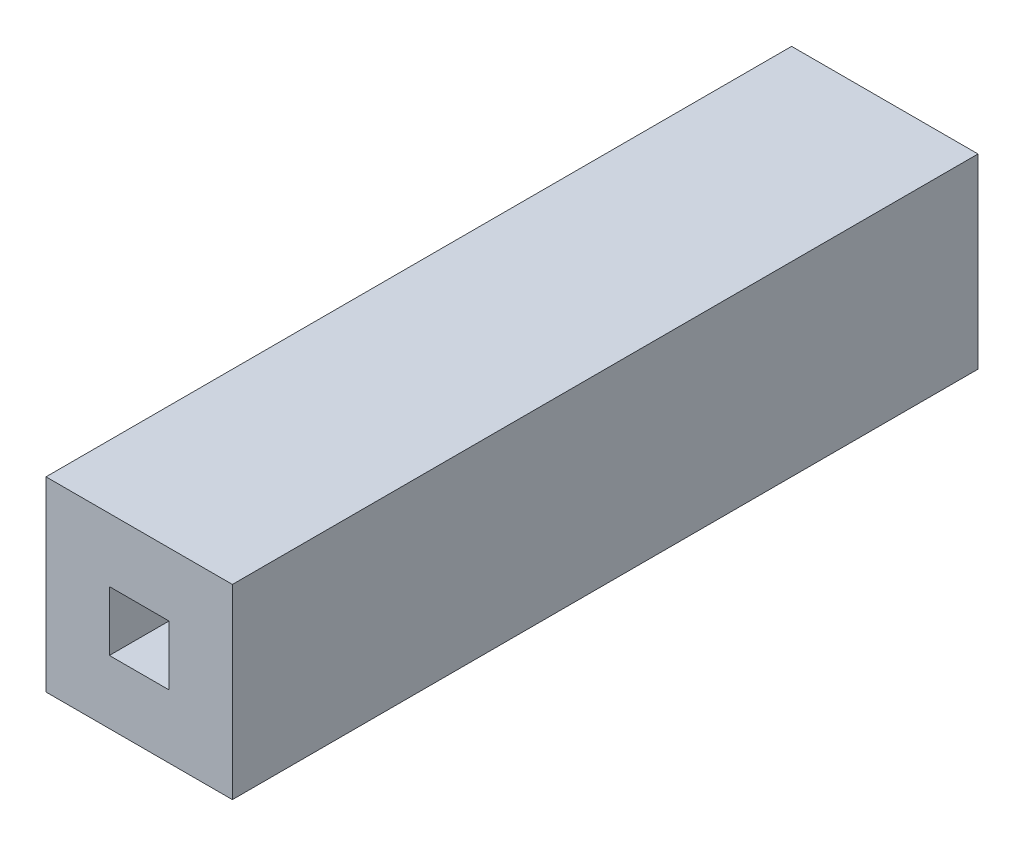
ISO-10303-21;
HEADER;
FILE_DESCRIPTION(('STEP AP214'),'2;1');
FILE_NAME('part.step','',(''),(''),'','','');
FILE_SCHEMA(('AUTOMOTIVE_DESIGN { 1 0 10303 214 1 1 1 1 }'));
ENDSEC;
DATA;
#1=APPLICATION_CONTEXT('core data for automotive mechanical design processes');
#2=APPLICATION_PROTOCOL_DEFINITION('international standard','automotive_design',2000,#1);
#3=PRODUCT_CONTEXT('',#1,'mechanical');
#4=PRODUCT('Part','Part','',(#3));
#5=PRODUCT_RELATED_PRODUCT_CATEGORY('part','',(#4));
#6=PRODUCT_DEFINITION_FORMATION('','',#4);
#7=PRODUCT_DEFINITION_CONTEXT('part definition',#1,'design');
#8=PRODUCT_DEFINITION('design','',#6,#7);
#9=PRODUCT_DEFINITION_SHAPE('','',#8);
#10=(LENGTH_UNIT() NAMED_UNIT(*) SI_UNIT(.MILLI.,.METRE.));
#11=(NAMED_UNIT(*) PLANE_ANGLE_UNIT() SI_UNIT($,.RADIAN.));
#12=(NAMED_UNIT(*) SI_UNIT($,.STERADIAN.) SOLID_ANGLE_UNIT());
#13=UNCERTAINTY_MEASURE_WITH_UNIT(LENGTH_MEASURE(1.E-05),#10,'distance_accuracy_value','');
#14=(GEOMETRIC_REPRESENTATION_CONTEXT(3) GLOBAL_UNCERTAINTY_ASSIGNED_CONTEXT((#13)) GLOBAL_UNIT_ASSIGNED_CONTEXT((#10,
#11,#12)) REPRESENTATION_CONTEXT('',''));
#15=CARTESIAN_POINT('',(0.,0.,0.));
#16=DIRECTION('',(0.,0.,1.));
#17=DIRECTION('',(1.,0.,0.));
#18=AXIS2_PLACEMENT_3D('',#15,#16,#17);
#19=CARTESIAN_POINT('',(-6.35,-6.35,50.8));
#20=DIRECTION('',(1.,0.,0.));
#21=DIRECTION('',(0.,0.,-1.));
#22=AXIS2_PLACEMENT_3D('',#19,#20,#21);
#23=PLANE('',#22);
#24=DIRECTION('',(0.,-1.,0.));
#25=VECTOR('',#24,1.);
#26=CARTESIAN_POINT('',(-6.35,-6.35,0.));
#27=LINE('',#26,#25);
#28=CARTESIAN_POINT('',(-6.35,6.35,0.));
#29=VERTEX_POINT('',#28);
#30=CARTESIAN_POINT('',(-6.35,-6.35,0.));
#31=VERTEX_POINT('',#30);
#32=EDGE_CURVE('E147',#29,#31,#27,.T.);
#33=ORIENTED_EDGE('',*,*,#32,.T.);
#34=DIRECTION('',(0.,0.,-1.));
#35=VECTOR('',#34,1.);
#36=CARTESIAN_POINT('',(-6.35,-6.35,50.8));
#37=LINE('',#36,#35);
#38=CARTESIAN_POINT('',(-6.35,-6.35,50.8));
#39=VERTEX_POINT('',#38);
#40=EDGE_CURVE('E11',#39,#31,#37,.T.);
#41=ORIENTED_EDGE('',*,*,#40,.F.);
#42=DIRECTION('',(0.,-1.,0.));
#43=VECTOR('',#42,1.);
#44=CARTESIAN_POINT('',(-6.35,-6.35,50.8));
#45=LINE('',#44,#43);
#46=CARTESIAN_POINT('',(-6.35,6.35,50.8));
#47=VERTEX_POINT('',#46);
#48=EDGE_CURVE('E153',#47,#39,#45,.T.);
#49=ORIENTED_EDGE('',*,*,#48,.F.);
#50=DIRECTION('',(0.,0.,-1.));
#51=VECTOR('',#50,1.);
#52=CARTESIAN_POINT('',(-6.35,6.35,50.8));
#53=LINE('',#52,#51);
#54=EDGE_CURVE('E167',#47,#29,#53,.T.);
#55=ORIENTED_EDGE('',*,*,#54,.T.);
#56=EDGE_LOOP('',(#33,#41,#49,#55));
#57=FACE_BOUND('',#56,.T.);
#58=ADVANCED_FACE('F39',(#57),#23,.F.);
#59=CARTESIAN_POINT('',(6.35,-6.35,50.8));
#60=DIRECTION('',(0.,1.,0.));
#61=DIRECTION('',(-1.,0.,0.));
#62=AXIS2_PLACEMENT_3D('',#59,#60,#61);
#63=PLANE('',#62);
#64=DIRECTION('',(1.,0.,0.));
#65=VECTOR('',#64,1.);
#66=CARTESIAN_POINT('',(6.35,-6.35,0.));
#67=LINE('',#66,#65);
#68=CARTESIAN_POINT('',(6.35,-6.35,0.));
#69=VERTEX_POINT('',#68);
#70=EDGE_CURVE('E171',#31,#69,#67,.T.);
#71=ORIENTED_EDGE('',*,*,#70,.T.);
#72=DIRECTION('',(0.,0.,-1.));
#73=VECTOR('',#72,1.);
#74=CARTESIAN_POINT('',(6.35,-6.35,50.8));
#75=LINE('',#74,#73);
#76=CARTESIAN_POINT('',(6.35,-6.35,50.8));
#77=VERTEX_POINT('',#76);
#78=EDGE_CURVE('E47',#77,#69,#75,.T.);
#79=ORIENTED_EDGE('',*,*,#78,.F.);
#80=DIRECTION('',(1.,0.,0.));
#81=VECTOR('',#80,1.);
#82=CARTESIAN_POINT('',(6.35,-6.35,50.8));
#83=LINE('',#82,#81);
#84=EDGE_CURVE('E157',#39,#77,#83,.T.);
#85=ORIENTED_EDGE('',*,*,#84,.F.);
#86=ORIENTED_EDGE('',*,*,#40,.T.);
#87=EDGE_LOOP('',(#71,#79,#85,#86));
#88=FACE_BOUND('',#87,.T.);
#89=ADVANCED_FACE('F205',(#88),#63,.F.);
#90=CARTESIAN_POINT('',(6.35,-6.35,50.8));
#91=DIRECTION('',(-1.,0.,0.));
#92=DIRECTION('',(0.,0.,1.));
#93=AXIS2_PLACEMENT_3D('',#90,#91,#92);
#94=PLANE('',#93);
#95=DIRECTION('',(0.,1.,0.));
#96=VECTOR('',#95,1.);
#97=CARTESIAN_POINT('',(6.35,-6.35,0.));
#98=LINE('',#97,#96);
#99=CARTESIAN_POINT('',(6.35,6.35,0.));
#100=VERTEX_POINT('',#99);
#101=EDGE_CURVE('E174',#69,#100,#98,.T.);
#102=ORIENTED_EDGE('',*,*,#101,.T.);
#103=DIRECTION('',(0.,0.,-1.));
#104=VECTOR('',#103,1.);
#105=CARTESIAN_POINT('',(6.35,6.35,50.8));
#106=LINE('',#105,#104);
#107=CARTESIAN_POINT('',(6.35,6.35,50.8));
#108=VERTEX_POINT('',#107);
#109=EDGE_CURVE('E182',#108,#100,#106,.T.);
#110=ORIENTED_EDGE('',*,*,#109,.F.);
#111=DIRECTION('',(0.,1.,0.));
#112=VECTOR('',#111,1.);
#113=CARTESIAN_POINT('',(6.35,-6.35,50.8));
#114=LINE('',#113,#112);
#115=EDGE_CURVE('E161',#77,#108,#114,.T.);
#116=ORIENTED_EDGE('',*,*,#115,.F.);
#117=ORIENTED_EDGE('',*,*,#78,.T.);
#118=EDGE_LOOP('',(#102,#110,#116,#117));
#119=FACE_BOUND('',#118,.T.);
#120=ADVANCED_FACE('F191',(#119),#94,.F.);
#121=CARTESIAN_POINT('',(6.35,6.35,50.8));
#122=DIRECTION('',(0.,-1.,0.));
#123=DIRECTION('',(1.,0.,0.));
#124=AXIS2_PLACEMENT_3D('',#121,#122,#123);
#125=PLANE('',#124);
#126=DIRECTION('',(-1.,0.,0.));
#127=VECTOR('',#126,1.);
#128=CARTESIAN_POINT('',(6.35,6.35,0.));
#129=LINE('',#128,#127);
#130=EDGE_CURVE('E158',#100,#29,#129,.T.);
#131=ORIENTED_EDGE('',*,*,#130,.T.);
#132=ORIENTED_EDGE('',*,*,#54,.F.);
#133=DIRECTION('',(-1.,0.,0.));
#134=VECTOR('',#133,1.);
#135=CARTESIAN_POINT('',(6.35,6.35,50.8));
#136=LINE('',#135,#134);
#137=EDGE_CURVE('E164',#108,#47,#136,.T.);
#138=ORIENTED_EDGE('',*,*,#137,.F.);
#139=ORIENTED_EDGE('',*,*,#109,.T.);
#140=EDGE_LOOP('',(#131,#132,#138,#139));
#141=FACE_BOUND('',#140,.T.);
#142=ADVANCED_FACE('F200',(#141),#125,.F.);
#143=CARTESIAN_POINT('',(0.,0.,50.8));
#144=DIRECTION('',(0.,0.,1.));
#145=DIRECTION('',(1.,0.,0.));
#146=AXIS2_PLACEMENT_3D('',#143,#144,#145);
#147=PLANE('',#146);
#148=DIRECTION('',(0.,-1.,0.));
#149=VECTOR('',#148,1.);
#150=CARTESIAN_POINT('',(2.032,-2.032,50.8));
#151=LINE('',#150,#149);
#152=CARTESIAN_POINT('',(2.032,2.032,50.8));
#153=VERTEX_POINT('',#152);
#154=CARTESIAN_POINT('',(2.032,-2.032,50.8));
#155=VERTEX_POINT('',#154);
#156=EDGE_CURVE('E106',#153,#155,#151,.T.);
#157=ORIENTED_EDGE('',*,*,#156,.T.);
#158=DIRECTION('',(-1.,0.,0.));
#159=VECTOR('',#158,1.);
#160=CARTESIAN_POINT('',(-2.032,-2.032,50.8));
#161=LINE('',#160,#159);
#162=CARTESIAN_POINT('',(-2.032,-2.032,50.8));
#163=VERTEX_POINT('',#162);
#164=EDGE_CURVE('E116',#155,#163,#161,.T.);
#165=ORIENTED_EDGE('',*,*,#164,.T.);
#166=DIRECTION('',(0.,1.,0.));
#167=VECTOR('',#166,1.);
#168=CARTESIAN_POINT('',(-2.032,-2.032,50.8));
#169=LINE('',#168,#167);
#170=CARTESIAN_POINT('',(-2.032,2.032,50.8));
#171=VERTEX_POINT('',#170);
#172=EDGE_CURVE('E54',#163,#171,#169,.T.);
#173=ORIENTED_EDGE('',*,*,#172,.T.);
#174=DIRECTION('',(1.,0.,0.));
#175=VECTOR('',#174,1.);
#176=CARTESIAN_POINT('',(-2.032,2.032,50.8));
#177=LINE('',#176,#175);
#178=EDGE_CURVE('E113',#171,#153,#177,.T.);
#179=ORIENTED_EDGE('',*,*,#178,.T.);
#180=EDGE_LOOP('',(#157,#165,#173,#179));
#181=FACE_BOUND('',#180,.T.);
#182=ORIENTED_EDGE('',*,*,#48,.T.);
#183=ORIENTED_EDGE('',*,*,#84,.T.);
#184=ORIENTED_EDGE('',*,*,#115,.T.);
#185=ORIENTED_EDGE('',*,*,#137,.T.);
#186=EDGE_LOOP('',(#182,#183,#184,#185));
#187=FACE_BOUND('',#186,.T.);
#188=ADVANCED_FACE('F121',(#181,#187),#147,.T.);
#189=CARTESIAN_POINT('',(0.,0.,0.));
#190=DIRECTION('',(0.,0.,1.));
#191=DIRECTION('',(1.,0.,0.));
#192=AXIS2_PLACEMENT_3D('',#189,#190,#191);
#193=PLANE('',#192);
#194=DIRECTION('',(-1.,0.,0.));
#195=VECTOR('',#194,1.);
#196=CARTESIAN_POINT('',(-2.032,-2.032,0.));
#197=LINE('',#196,#195);
#198=CARTESIAN_POINT('',(2.032,-2.032,0.));
#199=VERTEX_POINT('',#198);
#200=CARTESIAN_POINT('',(-2.032,-2.032,0.));
#201=VERTEX_POINT('',#200);
#202=EDGE_CURVE('E138',#199,#201,#197,.T.);
#203=ORIENTED_EDGE('',*,*,#202,.F.);
#204=DIRECTION('',(0.,-1.,0.));
#205=VECTOR('',#204,1.);
#206=CARTESIAN_POINT('',(2.032,-2.032,0.));
#207=LINE('',#206,#205);
#208=CARTESIAN_POINT('',(2.032,2.032,0.));
#209=VERTEX_POINT('',#208);
#210=EDGE_CURVE('E62',#209,#199,#207,.T.);
#211=ORIENTED_EDGE('',*,*,#210,.F.);
#212=DIRECTION('',(1.,0.,0.));
#213=VECTOR('',#212,1.);
#214=CARTESIAN_POINT('',(-2.032,2.032,0.));
#215=LINE('',#214,#213);
#216=CARTESIAN_POINT('',(-2.032,2.032,0.));
#217=VERTEX_POINT('',#216);
#218=EDGE_CURVE('E125',#217,#209,#215,.T.);
#219=ORIENTED_EDGE('',*,*,#218,.F.);
#220=DIRECTION('',(0.,1.,0.));
#221=VECTOR('',#220,1.);
#222=CARTESIAN_POINT('',(-2.032,-2.032,0.));
#223=LINE('',#222,#221);
#224=EDGE_CURVE('E129',#201,#217,#223,.T.);
#225=ORIENTED_EDGE('',*,*,#224,.F.);
#226=EDGE_LOOP('',(#203,#211,#219,#225));
#227=FACE_BOUND('',#226,.T.);
#228=ORIENTED_EDGE('',*,*,#32,.F.);
#229=ORIENTED_EDGE('',*,*,#130,.F.);
#230=ORIENTED_EDGE('',*,*,#101,.F.);
#231=ORIENTED_EDGE('',*,*,#70,.F.);
#232=EDGE_LOOP('',(#228,#229,#230,#231));
#233=FACE_BOUND('',#232,.T.);
#234=ADVANCED_FACE('F197',(#227,#233),#193,.F.);
#235=CARTESIAN_POINT('',(2.032,-2.032,50.8));
#236=DIRECTION('',(1.,0.,0.));
#237=DIRECTION('',(0.,0.,-1.));
#238=AXIS2_PLACEMENT_3D('',#235,#236,#237);
#239=PLANE('',#238);
#240=ORIENTED_EDGE('',*,*,#210,.T.);
#241=DIRECTION('',(0.,0.,-1.));
#242=VECTOR('',#241,1.);
#243=CARTESIAN_POINT('',(2.032,-2.032,50.8));
#244=LINE('',#243,#242);
#245=EDGE_CURVE('E102',#155,#199,#244,.T.);
#246=ORIENTED_EDGE('',*,*,#245,.F.);
#247=ORIENTED_EDGE('',*,*,#156,.F.);
#248=DIRECTION('',(0.,0.,-1.));
#249=VECTOR('',#248,1.);
#250=CARTESIAN_POINT('',(2.032,2.032,50.8));
#251=LINE('',#250,#249);
#252=EDGE_CURVE('E144',#153,#209,#251,.T.);
#253=ORIENTED_EDGE('',*,*,#252,.T.);
#254=EDGE_LOOP('',(#240,#246,#247,#253));
#255=FACE_BOUND('',#254,.T.);
#256=ADVANCED_FACE('F104',(#255),#239,.F.);
#257=CARTESIAN_POINT('',(-2.032,2.032,50.8));
#258=DIRECTION('',(0.,1.,0.));
#259=DIRECTION('',(-1.,0.,0.));
#260=AXIS2_PLACEMENT_3D('',#257,#258,#259);
#261=PLANE('',#260);
#262=ORIENTED_EDGE('',*,*,#218,.T.);
#263=ORIENTED_EDGE('',*,*,#252,.F.);
#264=ORIENTED_EDGE('',*,*,#178,.F.);
#265=DIRECTION('',(0.,0.,-1.));
#266=VECTOR('',#265,1.);
#267=CARTESIAN_POINT('',(-2.032,2.032,50.8));
#268=LINE('',#267,#266);
#269=EDGE_CURVE('E148',#171,#217,#268,.T.);
#270=ORIENTED_EDGE('',*,*,#269,.T.);
#271=EDGE_LOOP('',(#262,#263,#264,#270));
#272=FACE_BOUND('',#271,.T.);
#273=ADVANCED_FACE('F222',(#272),#261,.F.);
#274=CARTESIAN_POINT('',(-2.032,-2.032,50.8));
#275=DIRECTION('',(-1.,0.,0.));
#276=DIRECTION('',(0.,0.,1.));
#277=AXIS2_PLACEMENT_3D('',#274,#275,#276);
#278=PLANE('',#277);
#279=ORIENTED_EDGE('',*,*,#224,.T.);
#280=ORIENTED_EDGE('',*,*,#269,.F.);
#281=ORIENTED_EDGE('',*,*,#172,.F.);
#282=DIRECTION('',(0.,0.,-1.));
#283=VECTOR('',#282,1.);
#284=CARTESIAN_POINT('',(-2.032,-2.032,50.8));
#285=LINE('',#284,#283);
#286=EDGE_CURVE('E112',#163,#201,#285,.T.);
#287=ORIENTED_EDGE('',*,*,#286,.T.);
#288=EDGE_LOOP('',(#279,#280,#281,#287));
#289=FACE_BOUND('',#288,.T.);
#290=ADVANCED_FACE('F225',(#289),#278,.F.);
#291=CARTESIAN_POINT('',(-2.032,-2.032,50.8));
#292=DIRECTION('',(0.,-1.,0.));
#293=DIRECTION('',(1.,0.,0.));
#294=AXIS2_PLACEMENT_3D('',#291,#292,#293);
#295=PLANE('',#294);
#296=ORIENTED_EDGE('',*,*,#202,.T.);
#297=ORIENTED_EDGE('',*,*,#286,.F.);
#298=ORIENTED_EDGE('',*,*,#164,.F.);
#299=ORIENTED_EDGE('',*,*,#245,.T.);
#300=EDGE_LOOP('',(#296,#297,#298,#299));
#301=FACE_BOUND('',#300,.T.);
#302=ADVANCED_FACE('F117',(#301),#295,.F.);
#303=CLOSED_SHELL('',(#58,#89,#120,#142,#188,#234,#256,#273,#290,#302));
#304=MANIFOLD_SOLID_BREP('B2',#303);
#305=ADVANCED_BREP_SHAPE_REPRESENTATION('',(#18,#304),#14);
#306=SHAPE_DEFINITION_REPRESENTATION(#9,#305);
ENDSEC;
END-ISO-10303-21;
